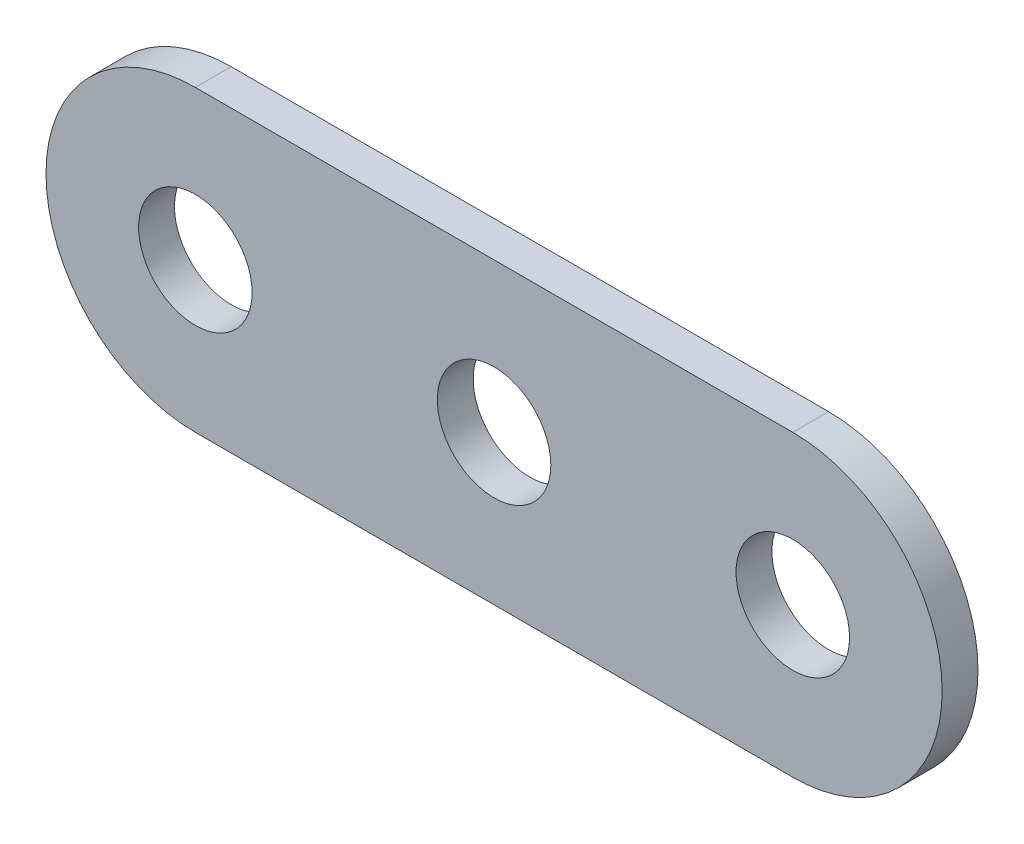
ISO-10303-21;
HEADER;
FILE_DESCRIPTION(('STEP AP214'),'2;1');
FILE_NAME('part.step','',(''),(''),'','','');
FILE_SCHEMA(('AUTOMOTIVE_DESIGN { 1 0 10303 214 1 1 1 1 }'));
ENDSEC;
DATA;
#1=APPLICATION_CONTEXT('core data for automotive mechanical design processes');
#2=APPLICATION_PROTOCOL_DEFINITION('international standard','automotive_design',2000,#1);
#3=PRODUCT_CONTEXT('',#1,'mechanical');
#4=PRODUCT('Part','Part','',(#3));
#5=PRODUCT_RELATED_PRODUCT_CATEGORY('part','',(#4));
#6=PRODUCT_DEFINITION_FORMATION('','',#4);
#7=PRODUCT_DEFINITION_CONTEXT('part definition',#1,'design');
#8=PRODUCT_DEFINITION('design','',#6,#7);
#9=PRODUCT_DEFINITION_SHAPE('','',#8);
#10=(LENGTH_UNIT() NAMED_UNIT(*) SI_UNIT(.MILLI.,.METRE.));
#11=(NAMED_UNIT(*) PLANE_ANGLE_UNIT() SI_UNIT($,.RADIAN.));
#12=(NAMED_UNIT(*) SI_UNIT($,.STERADIAN.) SOLID_ANGLE_UNIT());
#13=UNCERTAINTY_MEASURE_WITH_UNIT(LENGTH_MEASURE(1.E-05),#10,'distance_accuracy_value','');
#14=(GEOMETRIC_REPRESENTATION_CONTEXT(3) GLOBAL_UNCERTAINTY_ASSIGNED_CONTEXT((#13)) GLOBAL_UNIT_ASSIGNED_CONTEXT((#10,
#11,#12)) REPRESENTATION_CONTEXT('',''));
#15=CARTESIAN_POINT('',(0.,0.,0.));
#16=DIRECTION('',(0.,0.,1.));
#17=DIRECTION('',(1.,0.,0.));
#18=AXIS2_PLACEMENT_3D('',#15,#16,#17);
#19=CARTESIAN_POINT('',(-12.7,0.,1.524));
#20=DIRECTION('',(0.,0.,-1.));
#21=DIRECTION('',(-1.,0.,0.));
#22=AXIS2_PLACEMENT_3D('',#19,#20,#21);
#23=CYLINDRICAL_SURFACE('',#22,6.35);
#24=CARTESIAN_POINT('',(-12.7,0.,0.));
#25=DIRECTION('',(0.,0.,1.));
#26=DIRECTION('',(1.,0.,0.));
#27=AXIS2_PLACEMENT_3D('',#24,#25,#26);
#28=CIRCLE('',#27,6.35);
#29=CARTESIAN_POINT('',(-12.7,6.35,0.));
#30=VERTEX_POINT('',#29);
#31=CARTESIAN_POINT('',(-12.7,-6.35,0.));
#32=VERTEX_POINT('',#31);
#33=EDGE_CURVE('E99',#30,#32,#28,.T.);
#34=ORIENTED_EDGE('',*,*,#33,.T.);
#35=DIRECTION('',(0.,0.,-1.));
#36=VECTOR('',#35,1.);
#37=CARTESIAN_POINT('',(-12.7,-6.35,1.524));
#38=LINE('',#37,#36);
#39=CARTESIAN_POINT('',(-12.7,-6.35,1.524));
#40=VERTEX_POINT('',#39);
#41=EDGE_CURVE('E11',#40,#32,#38,.T.);
#42=ORIENTED_EDGE('',*,*,#41,.F.);
#43=CARTESIAN_POINT('',(-12.7,0.,1.524));
#44=DIRECTION('',(0.,0.,1.));
#45=DIRECTION('',(1.,0.,0.));
#46=AXIS2_PLACEMENT_3D('',#43,#44,#45);
#47=CIRCLE('',#46,6.35);
#48=CARTESIAN_POINT('',(-12.7,6.35,1.524));
#49=VERTEX_POINT('',#48);
#50=EDGE_CURVE('E87',#49,#40,#47,.T.);
#51=ORIENTED_EDGE('',*,*,#50,.F.);
#52=DIRECTION('',(0.,0.,-1.));
#53=VECTOR('',#52,1.);
#54=CARTESIAN_POINT('',(-12.7,6.35,1.524));
#55=LINE('',#54,#53);
#56=EDGE_CURVE('E95',#49,#30,#55,.T.);
#57=ORIENTED_EDGE('',*,*,#56,.T.);
#58=EDGE_LOOP('',(#34,#42,#51,#57));
#59=FACE_BOUND('',#58,.T.);
#60=ADVANCED_FACE('F36',(#59),#23,.T.);
#61=CARTESIAN_POINT('',(-12.7,-6.35,1.524));
#62=DIRECTION('',(0.,1.,0.));
#63=DIRECTION('',(0.,0.,1.));
#64=AXIS2_PLACEMENT_3D('',#61,#62,#63);
#65=PLANE('',#64);
#66=DIRECTION('',(1.,0.,0.));
#67=VECTOR('',#66,1.);
#68=CARTESIAN_POINT('',(-12.7,-6.35,0.));
#69=LINE('',#68,#67);
#70=CARTESIAN_POINT('',(12.7,-6.35,0.));
#71=VERTEX_POINT('',#70);
#72=EDGE_CURVE('E91',#32,#71,#69,.T.);
#73=ORIENTED_EDGE('',*,*,#72,.T.);
#74=DIRECTION('',(0.,0.,-1.));
#75=VECTOR('',#74,1.);
#76=CARTESIAN_POINT('',(12.7,-6.35,1.524));
#77=LINE('',#76,#75);
#78=CARTESIAN_POINT('',(12.7,-6.35,1.524));
#79=VERTEX_POINT('',#78);
#80=EDGE_CURVE('E44',#79,#71,#77,.T.);
#81=ORIENTED_EDGE('',*,*,#80,.F.);
#82=DIRECTION('',(1.,0.,0.));
#83=VECTOR('',#82,1.);
#84=CARTESIAN_POINT('',(-12.7,-6.35,1.524));
#85=LINE('',#84,#83);
#86=EDGE_CURVE('E82',#40,#79,#85,.T.);
#87=ORIENTED_EDGE('',*,*,#86,.F.);
#88=ORIENTED_EDGE('',*,*,#41,.T.);
#89=EDGE_LOOP('',(#73,#81,#87,#88));
#90=FACE_BOUND('',#89,.T.);
#91=ADVANCED_FACE('F90',(#90),#65,.F.);
#92=CARTESIAN_POINT('',(12.7,0.,1.524));
#93=DIRECTION('',(0.,0.,-1.));
#94=DIRECTION('',(-1.,0.,0.));
#95=AXIS2_PLACEMENT_3D('',#92,#93,#94);
#96=CYLINDRICAL_SURFACE('',#95,6.35);
#97=CARTESIAN_POINT('',(12.7,0.,0.));
#98=DIRECTION('',(0.,0.,1.));
#99=DIRECTION('',(-1.,0.,0.));
#100=AXIS2_PLACEMENT_3D('',#97,#98,#99);
#101=CIRCLE('',#100,6.35);
#102=CARTESIAN_POINT('',(12.7,6.35,0.));
#103=VERTEX_POINT('',#102);
#104=EDGE_CURVE('E69',#71,#103,#101,.T.);
#105=ORIENTED_EDGE('',*,*,#104,.T.);
#106=DIRECTION('',(0.,0.,-1.));
#107=VECTOR('',#106,1.);
#108=CARTESIAN_POINT('',(12.7,6.35,1.524));
#109=LINE('',#108,#107);
#110=CARTESIAN_POINT('',(12.7,6.35,1.524));
#111=VERTEX_POINT('',#110);
#112=EDGE_CURVE('E92',#111,#103,#109,.T.);
#113=ORIENTED_EDGE('',*,*,#112,.F.);
#114=CARTESIAN_POINT('',(12.7,0.,1.524));
#115=DIRECTION('',(0.,0.,1.));
#116=DIRECTION('',(-1.,0.,0.));
#117=AXIS2_PLACEMENT_3D('',#114,#115,#116);
#118=CIRCLE('',#117,6.35);
#119=EDGE_CURVE('E85',#79,#111,#118,.T.);
#120=ORIENTED_EDGE('',*,*,#119,.F.);
#121=ORIENTED_EDGE('',*,*,#80,.T.);
#122=EDGE_LOOP('',(#105,#113,#120,#121));
#123=FACE_BOUND('',#122,.T.);
#124=ADVANCED_FACE('F93',(#123),#96,.T.);
#125=CARTESIAN_POINT('',(-12.7,6.35,1.524));
#126=DIRECTION('',(0.,-1.,0.));
#127=DIRECTION('',(0.,0.,-1.));
#128=AXIS2_PLACEMENT_3D('',#125,#126,#127);
#129=PLANE('',#128);
#130=DIRECTION('',(-1.,0.,0.));
#131=VECTOR('',#130,1.);
#132=CARTESIAN_POINT('',(-12.7,6.35,0.));
#133=LINE('',#132,#131);
#134=EDGE_CURVE('E75',#103,#30,#133,.T.);
#135=ORIENTED_EDGE('',*,*,#134,.T.);
#136=ORIENTED_EDGE('',*,*,#56,.F.);
#137=DIRECTION('',(-1.,0.,0.));
#138=VECTOR('',#137,1.);
#139=CARTESIAN_POINT('',(-12.7,6.35,1.524));
#140=LINE('',#139,#138);
#141=EDGE_CURVE('E52',#111,#49,#140,.T.);
#142=ORIENTED_EDGE('',*,*,#141,.F.);
#143=ORIENTED_EDGE('',*,*,#112,.T.);
#144=EDGE_LOOP('',(#135,#136,#142,#143));
#145=FACE_BOUND('',#144,.T.);
#146=ADVANCED_FACE('F107',(#145),#129,.F.);
#147=CARTESIAN_POINT('',(-12.7,0.,1.524));
#148=DIRECTION('',(0.,0.,1.));
#149=DIRECTION('',(1.,0.,0.));
#150=AXIS2_PLACEMENT_3D('',#147,#148,#149);
#151=PLANE('',#150);
#152=CARTESIAN_POINT('',(12.7,0.,1.524));
#153=DIRECTION('',(0.,0.,1.));
#154=DIRECTION('',(1.,0.,0.));
#155=AXIS2_PLACEMENT_3D('',#152,#153,#154);
#156=CIRCLE('',#155,2.41299999999999);
#157=CARTESIAN_POINT('',(15.113,0.,1.524));
#158=VERTEX_POINT('',#157);
#159=EDGE_CURVE('E124',#158,#158,#156,.T.);
#160=ORIENTED_EDGE('',*,*,#159,.F.);
#161=EDGE_LOOP('',(#160));
#162=FACE_BOUND('',#161,.T.);
#163=CARTESIAN_POINT('',(0.,0.,1.524));
#164=DIRECTION('',(0.,0.,1.));
#165=DIRECTION('',(1.,0.,0.));
#166=AXIS2_PLACEMENT_3D('',#163,#164,#165);
#167=CIRCLE('',#166,2.41299999999999);
#168=CARTESIAN_POINT('',(2.41299999999999,0.,1.524));
#169=VERTEX_POINT('',#168);
#170=EDGE_CURVE('E116',#169,#169,#167,.T.);
#171=ORIENTED_EDGE('',*,*,#170,.F.);
#172=EDGE_LOOP('',(#171));
#173=FACE_BOUND('',#172,.T.);
#174=CARTESIAN_POINT('',(-12.7,0.,1.524));
#175=DIRECTION('',(0.,0.,1.));
#176=DIRECTION('',(1.,0.,0.));
#177=AXIS2_PLACEMENT_3D('',#174,#175,#176);
#178=CIRCLE('',#177,2.41299999999999);
#179=CARTESIAN_POINT('',(-10.287,0.,1.524));
#180=VERTEX_POINT('',#179);
#181=EDGE_CURVE('E113',#180,#180,#178,.T.);
#182=ORIENTED_EDGE('',*,*,#181,.F.);
#183=EDGE_LOOP('',(#182));
#184=FACE_BOUND('',#183,.T.);
#185=ORIENTED_EDGE('',*,*,#50,.T.);
#186=ORIENTED_EDGE('',*,*,#86,.T.);
#187=ORIENTED_EDGE('',*,*,#119,.T.);
#188=ORIENTED_EDGE('',*,*,#141,.T.);
#189=EDGE_LOOP('',(#185,#186,#187,#188));
#190=FACE_BOUND('',#189,.T.);
#191=ADVANCED_FACE('F83',(#162,#173,#184,#190),#151,.T.);
#192=CARTESIAN_POINT('',(-12.7,0.,0.));
#193=DIRECTION('',(0.,0.,1.));
#194=DIRECTION('',(1.,0.,0.));
#195=AXIS2_PLACEMENT_3D('',#192,#193,#194);
#196=PLANE('',#195);
#197=CARTESIAN_POINT('',(12.7,0.,0.));
#198=DIRECTION('',(0.,0.,1.));
#199=DIRECTION('',(1.,0.,0.));
#200=AXIS2_PLACEMENT_3D('',#197,#198,#199);
#201=CIRCLE('',#200,2.41299999999999);
#202=CARTESIAN_POINT('',(15.113,0.,0.));
#203=VERTEX_POINT('',#202);
#204=EDGE_CURVE('E127',#203,#203,#201,.T.);
#205=ORIENTED_EDGE('',*,*,#204,.T.);
#206=EDGE_LOOP('',(#205));
#207=FACE_BOUND('',#206,.T.);
#208=CARTESIAN_POINT('',(0.,0.,0.));
#209=DIRECTION('',(0.,0.,1.));
#210=DIRECTION('',(1.,0.,0.));
#211=AXIS2_PLACEMENT_3D('',#208,#209,#210);
#212=CIRCLE('',#211,2.41299999999999);
#213=CARTESIAN_POINT('',(2.41299999999999,0.,0.));
#214=VERTEX_POINT('',#213);
#215=EDGE_CURVE('E121',#214,#214,#212,.T.);
#216=ORIENTED_EDGE('',*,*,#215,.T.);
#217=EDGE_LOOP('',(#216));
#218=FACE_BOUND('',#217,.T.);
#219=CARTESIAN_POINT('',(-12.7,0.,0.));
#220=DIRECTION('',(0.,0.,1.));
#221=DIRECTION('',(1.,0.,0.));
#222=AXIS2_PLACEMENT_3D('',#219,#220,#221);
#223=CIRCLE('',#222,2.41299999999999);
#224=CARTESIAN_POINT('',(-10.287,0.,0.));
#225=VERTEX_POINT('',#224);
#226=EDGE_CURVE('E102',#225,#225,#223,.T.);
#227=ORIENTED_EDGE('',*,*,#226,.T.);
#228=EDGE_LOOP('',(#227));
#229=FACE_BOUND('',#228,.T.);
#230=ORIENTED_EDGE('',*,*,#33,.F.);
#231=ORIENTED_EDGE('',*,*,#134,.F.);
#232=ORIENTED_EDGE('',*,*,#104,.F.);
#233=ORIENTED_EDGE('',*,*,#72,.F.);
#234=EDGE_LOOP('',(#230,#231,#232,#233));
#235=FACE_BOUND('',#234,.T.);
#236=ADVANCED_FACE('F110',(#207,#218,#229,#235),#196,.F.);
#237=CARTESIAN_POINT('',(-12.7,0.,0.));
#238=DIRECTION('',(0.,0.,1.));
#239=DIRECTION('',(1.,0.,0.));
#240=AXIS2_PLACEMENT_3D('',#237,#238,#239);
#241=CYLINDRICAL_SURFACE('',#240,2.41299999999999);
#242=ORIENTED_EDGE('',*,*,#226,.F.);
#243=EDGE_LOOP('',(#242));
#244=FACE_BOUND('',#243,.T.);
#245=ORIENTED_EDGE('',*,*,#181,.T.);
#246=EDGE_LOOP('',(#245));
#247=FACE_BOUND('',#246,.T.);
#248=ADVANCED_FACE('F147',(#244,#247),#241,.F.);
#249=CARTESIAN_POINT('',(0.,0.,0.));
#250=DIRECTION('',(0.,0.,1.));
#251=DIRECTION('',(1.,0.,0.));
#252=AXIS2_PLACEMENT_3D('',#249,#250,#251);
#253=CYLINDRICAL_SURFACE('',#252,2.41299999999999);
#254=ORIENTED_EDGE('',*,*,#215,.F.);
#255=EDGE_LOOP('',(#254));
#256=FACE_BOUND('',#255,.T.);
#257=ORIENTED_EDGE('',*,*,#170,.T.);
#258=EDGE_LOOP('',(#257));
#259=FACE_BOUND('',#258,.T.);
#260=ADVANCED_FACE('F136',(#256,#259),#253,.F.);
#261=CARTESIAN_POINT('',(12.7,0.,0.));
#262=DIRECTION('',(0.,0.,1.));
#263=DIRECTION('',(1.,0.,0.));
#264=AXIS2_PLACEMENT_3D('',#261,#262,#263);
#265=CYLINDRICAL_SURFACE('',#264,2.41299999999999);
#266=ORIENTED_EDGE('',*,*,#204,.F.);
#267=EDGE_LOOP('',(#266));
#268=FACE_BOUND('',#267,.T.);
#269=ORIENTED_EDGE('',*,*,#159,.T.);
#270=EDGE_LOOP('',(#269));
#271=FACE_BOUND('',#270,.T.);
#272=ADVANCED_FACE('F133',(#268,#271),#265,.F.);
#273=CLOSED_SHELL('',(#60,#91,#124,#146,#191,#236,#248,#260,#272));
#274=MANIFOLD_SOLID_BREP('B2',#273);
#275=ADVANCED_BREP_SHAPE_REPRESENTATION('',(#18,#274),#14);
#276=SHAPE_DEFINITION_REPRESENTATION(#9,#275);
ENDSEC;
END-ISO-10303-21;
